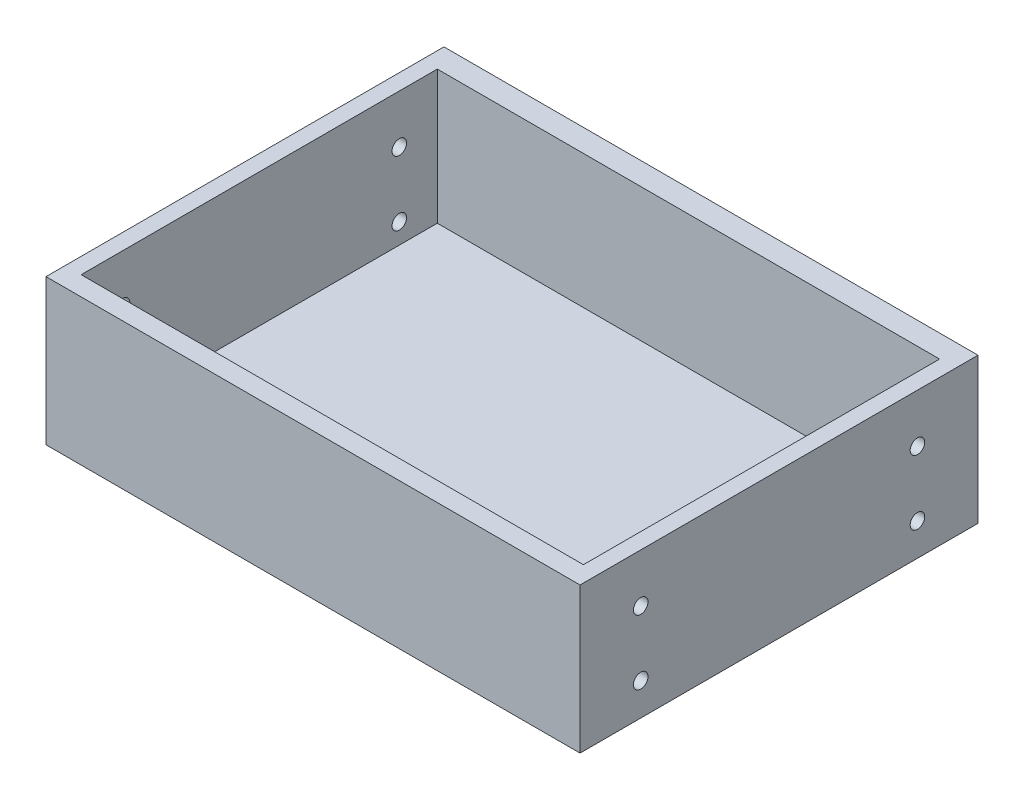
ISO-10303-21;
HEADER;
FILE_DESCRIPTION(('STEP AP214'),'2;1');
FILE_NAME('part.step','',(''),(''),'','','');
FILE_SCHEMA(('AUTOMOTIVE_DESIGN { 1 0 10303 214 1 1 1 1 }'));
ENDSEC;
DATA;
#1=APPLICATION_CONTEXT('core data for automotive mechanical design processes');
#2=APPLICATION_PROTOCOL_DEFINITION('international standard','automotive_design',2000,#1);
#3=PRODUCT_CONTEXT('',#1,'mechanical');
#4=PRODUCT('Part','Part','',(#3));
#5=PRODUCT_RELATED_PRODUCT_CATEGORY('part','',(#4));
#6=PRODUCT_DEFINITION_FORMATION('','',#4);
#7=PRODUCT_DEFINITION_CONTEXT('part definition',#1,'design');
#8=PRODUCT_DEFINITION('design','',#6,#7);
#9=PRODUCT_DEFINITION_SHAPE('','',#8);
#10=(LENGTH_UNIT() NAMED_UNIT(*) SI_UNIT(.MILLI.,.METRE.));
#11=(NAMED_UNIT(*) PLANE_ANGLE_UNIT() SI_UNIT($,.RADIAN.));
#12=(NAMED_UNIT(*) SI_UNIT($,.STERADIAN.) SOLID_ANGLE_UNIT());
#13=UNCERTAINTY_MEASURE_WITH_UNIT(LENGTH_MEASURE(1.E-05),#10,'distance_accuracy_value','');
#14=(GEOMETRIC_REPRESENTATION_CONTEXT(3) GLOBAL_UNCERTAINTY_ASSIGNED_CONTEXT((#13)) GLOBAL_UNIT_ASSIGNED_CONTEXT((#10,
#11,#12)) REPRESENTATION_CONTEXT('',''));
#15=CARTESIAN_POINT('',(0.,0.,0.));
#16=DIRECTION('',(0.,0.,1.));
#17=DIRECTION('',(1.,0.,0.));
#18=AXIS2_PLACEMENT_3D('',#15,#16,#17);
#19=CARTESIAN_POINT('',(0.,0.,0.));
#20=DIRECTION('',(0.,1.,0.));
#21=DIRECTION('',(0.,0.,1.));
#22=AXIS2_PLACEMENT_3D('',#19,#20,#21);
#23=PLANE('',#22);
#24=DIRECTION('',(0.,0.,-1.));
#25=VECTOR('',#24,1.);
#26=CARTESIAN_POINT('',(-440.,0.,0.));
#27=LINE('',#26,#25);
#28=CARTESIAN_POINT('',(-440.,0.,0.));
#29=VERTEX_POINT('',#28);
#30=CARTESIAN_POINT('',(-440.,0.,-327.889328917823));
#31=VERTEX_POINT('',#30);
#32=EDGE_CURVE('E175',#29,#31,#27,.T.);
#33=ORIENTED_EDGE('',*,*,#32,.T.);
#34=DIRECTION('',(-1.,0.,0.));
#35=VECTOR('',#34,1.);
#36=CARTESIAN_POINT('',(-1.24101232668224E-13,0.,-327.889328917823));
#37=LINE('',#36,#35);
#38=CARTESIAN_POINT('',(0.,0.,-327.889328917823));
#39=VERTEX_POINT('',#38);
#40=EDGE_CURVE('E182',#39,#31,#37,.T.);
#41=ORIENTED_EDGE('',*,*,#40,.F.);
#42=DIRECTION('',(0.,0.,-1.));
#43=VECTOR('',#42,1.);
#44=CARTESIAN_POINT('',(0.,0.,0.));
#45=LINE('',#44,#43);
#46=CARTESIAN_POINT('',(0.,0.,0.));
#47=VERTEX_POINT('',#46);
#48=EDGE_CURVE('E193',#47,#39,#45,.T.);
#49=ORIENTED_EDGE('',*,*,#48,.F.);
#50=DIRECTION('',(-1.,0.,0.));
#51=VECTOR('',#50,1.);
#52=CARTESIAN_POINT('',(0.,0.,0.));
#53=LINE('',#52,#51);
#54=EDGE_CURVE('E190',#47,#29,#53,.T.);
#55=ORIENTED_EDGE('',*,*,#54,.T.);
#56=EDGE_LOOP('',(#33,#41,#49,#55));
#57=FACE_BOUND('',#56,.T.);
#58=ADVANCED_FACE('F65',(#57),#23,.F.);
#59=CARTESIAN_POINT('',(0.,120.,0.));
#60=DIRECTION('',(-1.,0.,0.));
#61=DIRECTION('',(0.,0.,1.));
#62=AXIS2_PLACEMENT_3D('',#59,#60,#61);
#63=PLANE('',#62);
#64=CARTESIAN_POINT('',(0.,80.,-278.));
#65=DIRECTION('',(1.,0.,0.));
#66=DIRECTION('',(0.,0.,-1.));
#67=AXIS2_PLACEMENT_3D('',#64,#65,#66);
#68=CIRCLE('',#67,5.99999999999999);
#69=CARTESIAN_POINT('',(0.,80.,-284.));
#70=VERTEX_POINT('',#69);
#71=EDGE_CURVE('E286',#70,#70,#68,.T.);
#72=ORIENTED_EDGE('',*,*,#71,.F.);
#73=EDGE_LOOP('',(#72));
#74=FACE_BOUND('',#73,.T.);
#75=CARTESIAN_POINT('',(0.,26.7195606006157,-50.));
#76=DIRECTION('',(1.,0.,0.));
#77=DIRECTION('',(0.,0.,-1.));
#78=AXIS2_PLACEMENT_3D('',#75,#76,#77);
#79=CIRCLE('',#78,6.01746788141037);
#80=CARTESIAN_POINT('',(0.,26.7195606006157,-56.0174678814104));
#81=VERTEX_POINT('',#80);
#82=EDGE_CURVE('E290',#81,#81,#79,.T.);
#83=ORIENTED_EDGE('',*,*,#82,.F.);
#84=EDGE_LOOP('',(#83));
#85=FACE_BOUND('',#84,.T.);
#86=CARTESIAN_POINT('',(0.,26.7195606006157,-278.));
#87=DIRECTION('',(1.,0.,0.));
#88=DIRECTION('',(0.,0.,-1.));
#89=AXIS2_PLACEMENT_3D('',#86,#87,#88);
#90=CIRCLE('',#89,5.99999999999999);
#91=CARTESIAN_POINT('',(0.,26.7195606006157,-284.));
#92=VERTEX_POINT('',#91);
#93=EDGE_CURVE('E294',#92,#92,#90,.T.);
#94=ORIENTED_EDGE('',*,*,#93,.F.);
#95=EDGE_LOOP('',(#94));
#96=FACE_BOUND('',#95,.T.);
#97=CARTESIAN_POINT('',(0.,80.,-50.));
#98=DIRECTION('',(1.,0.,0.));
#99=DIRECTION('',(0.,0.,-1.));
#100=AXIS2_PLACEMENT_3D('',#97,#98,#99);
#101=CIRCLE('',#100,6.00000000000001);
#102=CARTESIAN_POINT('',(0.,80.,-56.));
#103=VERTEX_POINT('',#102);
#104=EDGE_CURVE('E205',#103,#103,#101,.T.);
#105=ORIENTED_EDGE('',*,*,#104,.F.);
#106=EDGE_LOOP('',(#105));
#107=FACE_BOUND('',#106,.T.);
#108=ORIENTED_EDGE('',*,*,#48,.T.);
#109=DIRECTION('',(0.,-1.,0.));
#110=VECTOR('',#109,1.);
#111=CARTESIAN_POINT('',(0.,120.,-327.889328917823));
#112=LINE('',#111,#110);
#113=CARTESIAN_POINT('',(0.,120.,-327.889328917823));
#114=VERTEX_POINT('',#113);
#115=EDGE_CURVE('E197',#114,#39,#112,.T.);
#116=ORIENTED_EDGE('',*,*,#115,.F.);
#117=DIRECTION('',(0.,0.,-1.));
#118=VECTOR('',#117,1.);
#119=CARTESIAN_POINT('',(0.,120.,0.));
#120=LINE('',#119,#118);
#121=CARTESIAN_POINT('',(0.,120.,0.));
#122=VERTEX_POINT('',#121);
#123=EDGE_CURVE('E185',#122,#114,#120,.T.);
#124=ORIENTED_EDGE('',*,*,#123,.F.);
#125=DIRECTION('',(0.,-1.,0.));
#126=VECTOR('',#125,1.);
#127=CARTESIAN_POINT('',(0.,120.,0.));
#128=LINE('',#127,#126);
#129=EDGE_CURVE('E74',#122,#47,#128,.T.);
#130=ORIENTED_EDGE('',*,*,#129,.T.);
#131=EDGE_LOOP('',(#108,#116,#124,#130));
#132=FACE_BOUND('',#131,.T.);
#133=ADVANCED_FACE('F264',(#74,#85,#96,#107,#132),#63,.F.);
#134=CARTESIAN_POINT('',(0.,120.,0.));
#135=DIRECTION('',(0.,0.,1.));
#136=DIRECTION('',(1.,0.,0.));
#137=AXIS2_PLACEMENT_3D('',#134,#135,#136);
#138=PLANE('',#137);
#139=ORIENTED_EDGE('',*,*,#54,.F.);
#140=ORIENTED_EDGE('',*,*,#129,.F.);
#141=DIRECTION('',(-1.,0.,0.));
#142=VECTOR('',#141,1.);
#143=CARTESIAN_POINT('',(0.,120.,0.));
#144=LINE('',#143,#142);
#145=CARTESIAN_POINT('',(-440.,120.,0.));
#146=VERTEX_POINT('',#145);
#147=EDGE_CURVE('E181',#122,#146,#144,.T.);
#148=ORIENTED_EDGE('',*,*,#147,.T.);
#149=DIRECTION('',(0.,-1.,0.));
#150=VECTOR('',#149,1.);
#151=CARTESIAN_POINT('',(-440.,120.,0.));
#152=LINE('',#151,#150);
#153=EDGE_CURVE('E12',#146,#29,#152,.T.);
#154=ORIENTED_EDGE('',*,*,#153,.T.);
#155=EDGE_LOOP('',(#139,#140,#148,#154));
#156=FACE_BOUND('',#155,.T.);
#157=ADVANCED_FACE('F249',(#156),#138,.T.);
#158=CARTESIAN_POINT('',(-440.,120.,0.));
#159=DIRECTION('',(-1.,0.,0.));
#160=DIRECTION('',(0.,0.,1.));
#161=AXIS2_PLACEMENT_3D('',#158,#159,#160);
#162=PLANE('',#161);
#163=CARTESIAN_POINT('',(-440.,26.7195606006157,-278.));
#164=DIRECTION('',(-1.,0.,0.));
#165=DIRECTION('',(0.,0.,1.));
#166=AXIS2_PLACEMENT_3D('',#163,#164,#165);
#167=CIRCLE('',#166,5.99999999999999);
#168=CARTESIAN_POINT('',(-440.,26.7195606006157,-272.));
#169=VERTEX_POINT('',#168);
#170=EDGE_CURVE('E163',#169,#169,#167,.T.);
#171=ORIENTED_EDGE('',*,*,#170,.F.);
#172=EDGE_LOOP('',(#171));
#173=FACE_BOUND('',#172,.T.);
#174=CARTESIAN_POINT('',(-440.,80.,-50.));
#175=DIRECTION('',(-1.,0.,0.));
#176=DIRECTION('',(0.,0.,1.));
#177=AXIS2_PLACEMENT_3D('',#174,#175,#176);
#178=CIRCLE('',#177,6.);
#179=CARTESIAN_POINT('',(-440.,80.,-44.));
#180=VERTEX_POINT('',#179);
#181=EDGE_CURVE('E236',#180,#180,#178,.T.);
#182=ORIENTED_EDGE('',*,*,#181,.F.);
#183=EDGE_LOOP('',(#182));
#184=FACE_BOUND('',#183,.T.);
#185=CARTESIAN_POINT('',(-440.,26.7195606006157,-50.));
#186=DIRECTION('',(-1.,0.,0.));
#187=DIRECTION('',(0.,0.,1.));
#188=AXIS2_PLACEMENT_3D('',#185,#186,#187);
#189=CIRCLE('',#188,6.01746788141037);
#190=CARTESIAN_POINT('',(-440.,26.7195606006157,-43.9825321185896));
#191=VERTEX_POINT('',#190);
#192=EDGE_CURVE('E234',#191,#191,#189,.T.);
#193=ORIENTED_EDGE('',*,*,#192,.F.);
#194=EDGE_LOOP('',(#193));
#195=FACE_BOUND('',#194,.T.);
#196=CARTESIAN_POINT('',(-440.,80.,-278.));
#197=DIRECTION('',(-1.,0.,0.));
#198=DIRECTION('',(0.,0.,1.));
#199=AXIS2_PLACEMENT_3D('',#196,#197,#198);
#200=CIRCLE('',#199,5.99999999999999);
#201=CARTESIAN_POINT('',(-440.,80.,-272.));
#202=VERTEX_POINT('',#201);
#203=EDGE_CURVE('E231',#202,#202,#200,.T.);
#204=ORIENTED_EDGE('',*,*,#203,.F.);
#205=EDGE_LOOP('',(#204));
#206=FACE_BOUND('',#205,.T.);
#207=ORIENTED_EDGE('',*,*,#32,.F.);
#208=ORIENTED_EDGE('',*,*,#153,.F.);
#209=DIRECTION('',(0.,0.,-1.));
#210=VECTOR('',#209,1.);
#211=CARTESIAN_POINT('',(-440.,120.,0.));
#212=LINE('',#211,#210);
#213=CARTESIAN_POINT('',(-440.,120.,-327.889328917823));
#214=VERTEX_POINT('',#213);
#215=EDGE_CURVE('E179',#146,#214,#212,.T.);
#216=ORIENTED_EDGE('',*,*,#215,.T.);
#217=DIRECTION('',(0.,-1.,0.));
#218=VECTOR('',#217,1.);
#219=CARTESIAN_POINT('',(-440.,120.,-327.889328917823));
#220=LINE('',#219,#218);
#221=EDGE_CURVE('E111',#214,#31,#220,.T.);
#222=ORIENTED_EDGE('',*,*,#221,.T.);
#223=EDGE_LOOP('',(#207,#208,#216,#222));
#224=FACE_BOUND('',#223,.T.);
#225=ADVANCED_FACE('F67',(#173,#184,#195,#206,#224),#162,.T.);
#226=CARTESIAN_POINT('',(-1.24101232668224E-13,120.,-327.889328917823));
#227=DIRECTION('',(0.,0.,1.));
#228=DIRECTION('',(1.,0.,0.));
#229=AXIS2_PLACEMENT_3D('',#226,#227,#228);
#230=PLANE('',#229);
#231=ORIENTED_EDGE('',*,*,#40,.T.);
#232=ORIENTED_EDGE('',*,*,#221,.F.);
#233=DIRECTION('',(-1.,0.,0.));
#234=VECTOR('',#233,1.);
#235=CARTESIAN_POINT('',(-1.24101232668224E-13,120.,-327.889328917823));
#236=LINE('',#235,#234);
#237=EDGE_CURVE('E91',#114,#214,#236,.T.);
#238=ORIENTED_EDGE('',*,*,#237,.F.);
#239=ORIENTED_EDGE('',*,*,#115,.T.);
#240=EDGE_LOOP('',(#231,#232,#238,#239));
#241=FACE_BOUND('',#240,.T.);
#242=ADVANCED_FACE('F248',(#241),#230,.F.);
#243=CARTESIAN_POINT('',(0.,120.,0.));
#244=DIRECTION('',(0.,1.,0.));
#245=DIRECTION('',(0.,0.,1.));
#246=AXIS2_PLACEMENT_3D('',#243,#244,#245);
#247=PLANE('',#246);
#248=DIRECTION('',(0.,0.,1.));
#249=VECTOR('',#248,1.);
#250=CARTESIAN_POINT('',(-426.908795826111,120.,-15.8670164446765));
#251=LINE('',#250,#249);
#252=CARTESIAN_POINT('',(-426.908795826111,120.,-309.308926619538));
#253=VERTEX_POINT('',#252);
#254=CARTESIAN_POINT('',(-426.908795826111,120.,-15.8670164446765));
#255=VERTEX_POINT('',#254);
#256=EDGE_CURVE('E82',#253,#255,#251,.T.);
#257=ORIENTED_EDGE('',*,*,#256,.F.);
#258=DIRECTION('',(-1.,0.,0.));
#259=VECTOR('',#258,1.);
#260=CARTESIAN_POINT('',(-13.0804609641261,120.,-309.308926619538));
#261=LINE('',#260,#259);
#262=CARTESIAN_POINT('',(-13.0804609641261,120.,-309.308926619538));
#263=VERTEX_POINT('',#262);
#264=EDGE_CURVE('E157',#263,#253,#261,.T.);
#265=ORIENTED_EDGE('',*,*,#264,.F.);
#266=DIRECTION('',(0.,0.,-1.));
#267=VECTOR('',#266,1.);
#268=CARTESIAN_POINT('',(-13.0804609641261,120.,-15.8670164446765));
#269=LINE('',#268,#267);
#270=CARTESIAN_POINT('',(-13.0804609641261,120.,-15.8670164446765));
#271=VERTEX_POINT('',#270);
#272=EDGE_CURVE('E160',#271,#263,#269,.T.);
#273=ORIENTED_EDGE('',*,*,#272,.F.);
#274=DIRECTION('',(1.,0.,0.));
#275=VECTOR('',#274,1.);
#276=CARTESIAN_POINT('',(-13.0804609641261,120.,-15.8670164446765));
#277=LINE('',#276,#275);
#278=EDGE_CURVE('E169',#255,#271,#277,.T.);
#279=ORIENTED_EDGE('',*,*,#278,.F.);
#280=EDGE_LOOP('',(#257,#265,#273,#279));
#281=FACE_BOUND('',#280,.T.);
#282=ORIENTED_EDGE('',*,*,#215,.F.);
#283=ORIENTED_EDGE('',*,*,#147,.F.);
#284=ORIENTED_EDGE('',*,*,#123,.T.);
#285=ORIENTED_EDGE('',*,*,#237,.T.);
#286=EDGE_LOOP('',(#282,#283,#284,#285));
#287=FACE_BOUND('',#286,.T.);
#288=ADVANCED_FACE('F261',(#281,#287),#247,.T.);
#289=CARTESIAN_POINT('',(-426.908795826111,10.0000000000001,-15.8670164446765));
#290=DIRECTION('',(-1.,0.,0.));
#291=DIRECTION('',(0.,0.,1.));
#292=AXIS2_PLACEMENT_3D('',#289,#290,#291);
#293=PLANE('',#292);
#294=CARTESIAN_POINT('',(-426.908795826111,26.7195606006157,-278.));
#295=DIRECTION('',(1.,0.,0.));
#296=DIRECTION('',(0.,0.,-1.));
#297=AXIS2_PLACEMENT_3D('',#294,#295,#296);
#298=CIRCLE('',#297,5.99999999999999);
#299=CARTESIAN_POINT('',(-426.908795826111,26.7195606006157,-284.));
#300=VERTEX_POINT('',#299);
#301=EDGE_CURVE('E221',#300,#300,#298,.T.);
#302=ORIENTED_EDGE('',*,*,#301,.F.);
#303=EDGE_LOOP('',(#302));
#304=FACE_BOUND('',#303,.T.);
#305=CARTESIAN_POINT('',(-426.908795826111,80.,-50.));
#306=DIRECTION('',(1.,0.,0.));
#307=DIRECTION('',(0.,0.,-1.));
#308=AXIS2_PLACEMENT_3D('',#305,#306,#307);
#309=CIRCLE('',#308,6.);
#310=CARTESIAN_POINT('',(-426.908795826111,80.,-56.));
#311=VERTEX_POINT('',#310);
#312=EDGE_CURVE('E216',#311,#311,#309,.T.);
#313=ORIENTED_EDGE('',*,*,#312,.F.);
#314=EDGE_LOOP('',(#313));
#315=FACE_BOUND('',#314,.T.);
#316=CARTESIAN_POINT('',(-426.908795826111,26.7195606006157,-50.));
#317=DIRECTION('',(1.,0.,0.));
#318=DIRECTION('',(0.,0.,-1.));
#319=AXIS2_PLACEMENT_3D('',#316,#317,#318);
#320=CIRCLE('',#319,6.01746788141037);
#321=CARTESIAN_POINT('',(-426.908795826111,26.7195606006157,-56.0174678814104));
#322=VERTEX_POINT('',#321);
#323=EDGE_CURVE('E212',#322,#322,#320,.T.);
#324=ORIENTED_EDGE('',*,*,#323,.F.);
#325=EDGE_LOOP('',(#324));
#326=FACE_BOUND('',#325,.T.);
#327=CARTESIAN_POINT('',(-426.908795826111,80.,-278.));
#328=DIRECTION('',(1.,0.,0.));
#329=DIRECTION('',(0.,0.,-1.));
#330=AXIS2_PLACEMENT_3D('',#327,#328,#329);
#331=CIRCLE('',#330,5.99999999999999);
#332=CARTESIAN_POINT('',(-426.908795826111,80.,-284.));
#333=VERTEX_POINT('',#332);
#334=EDGE_CURVE('E227',#333,#333,#331,.T.);
#335=ORIENTED_EDGE('',*,*,#334,.F.);
#336=EDGE_LOOP('',(#335));
#337=FACE_BOUND('',#336,.T.);
#338=ORIENTED_EDGE('',*,*,#256,.T.);
#339=DIRECTION('',(0.,1.,0.));
#340=VECTOR('',#339,1.);
#341=CARTESIAN_POINT('',(-426.908795826111,10.0000000000001,-15.8670164446765));
#342=LINE('',#341,#340);
#343=CARTESIAN_POINT('',(-426.908795826111,10.0000000000001,-15.8670164446765));
#344=VERTEX_POINT('',#343);
#345=EDGE_CURVE('E135',#344,#255,#342,.T.);
#346=ORIENTED_EDGE('',*,*,#345,.F.);
#347=DIRECTION('',(0.,0.,1.));
#348=VECTOR('',#347,1.);
#349=CARTESIAN_POINT('',(-426.908795826111,10.0000000000001,-15.8670164446765));
#350=LINE('',#349,#348);
#351=CARTESIAN_POINT('',(-426.908795826111,10.0000000000001,-309.308926619538));
#352=VERTEX_POINT('',#351);
#353=EDGE_CURVE('E139',#352,#344,#350,.T.);
#354=ORIENTED_EDGE('',*,*,#353,.F.);
#355=DIRECTION('',(0.,1.,0.));
#356=VECTOR('',#355,1.);
#357=CARTESIAN_POINT('',(-426.908795826111,10.0000000000001,-309.308926619538));
#358=LINE('',#357,#356);
#359=EDGE_CURVE('E173',#352,#253,#358,.T.);
#360=ORIENTED_EDGE('',*,*,#359,.T.);
#361=EDGE_LOOP('',(#338,#346,#354,#360));
#362=FACE_BOUND('',#361,.T.);
#363=ADVANCED_FACE('F137',(#304,#315,#326,#337,#362),#293,.F.);
#364=CARTESIAN_POINT('',(-13.0804609641261,10.0000000000001,-309.308926619538));
#365=DIRECTION('',(0.,0.,-1.));
#366=DIRECTION('',(-1.,0.,0.));
#367=AXIS2_PLACEMENT_3D('',#364,#365,#366);
#368=PLANE('',#367);
#369=ORIENTED_EDGE('',*,*,#264,.T.);
#370=ORIENTED_EDGE('',*,*,#359,.F.);
#371=DIRECTION('',(-1.,0.,0.));
#372=VECTOR('',#371,1.);
#373=CARTESIAN_POINT('',(-13.0804609641261,10.0000000000001,-309.308926619538));
#374=LINE('',#373,#372);
#375=CARTESIAN_POINT('',(-13.0804609641261,10.0000000000001,-309.308926619538));
#376=VERTEX_POINT('',#375);
#377=EDGE_CURVE('E145',#376,#352,#374,.T.);
#378=ORIENTED_EDGE('',*,*,#377,.F.);
#379=DIRECTION('',(0.,1.,0.));
#380=VECTOR('',#379,1.);
#381=CARTESIAN_POINT('',(-13.0804609641261,10.0000000000001,-309.308926619538));
#382=LINE('',#381,#380);
#383=EDGE_CURVE('E176',#376,#263,#382,.T.);
#384=ORIENTED_EDGE('',*,*,#383,.T.);
#385=EDGE_LOOP('',(#369,#370,#378,#384));
#386=FACE_BOUND('',#385,.T.);
#387=ADVANCED_FACE('F332',(#386),#368,.F.);
#388=CARTESIAN_POINT('',(-13.0804609641261,10.0000000000001,-15.8670164446765));
#389=DIRECTION('',(1.,0.,0.));
#390=DIRECTION('',(0.,0.,-1.));
#391=AXIS2_PLACEMENT_3D('',#388,#389,#390);
#392=PLANE('',#391);
#393=CARTESIAN_POINT('',(-13.0804609641261,80.,-278.));
#394=DIRECTION('',(1.,0.,0.));
#395=DIRECTION('',(0.,0.,-1.));
#396=AXIS2_PLACEMENT_3D('',#393,#394,#395);
#397=CIRCLE('',#396,5.99999999999999);
#398=CARTESIAN_POINT('',(-13.0804609641261,80.,-284.));
#399=VERTEX_POINT('',#398);
#400=EDGE_CURVE('E69',#399,#399,#397,.T.);
#401=ORIENTED_EDGE('',*,*,#400,.T.);
#402=EDGE_LOOP('',(#401));
#403=FACE_BOUND('',#402,.T.);
#404=CARTESIAN_POINT('',(-13.0804609641261,26.7195606006157,-50.));
#405=DIRECTION('',(1.,0.,0.));
#406=DIRECTION('',(0.,0.,-1.));
#407=AXIS2_PLACEMENT_3D('',#404,#405,#406);
#408=CIRCLE('',#407,6.01746788141037);
#409=CARTESIAN_POINT('',(-13.0804609641261,26.7195606006157,-56.0174678814104));
#410=VERTEX_POINT('',#409);
#411=EDGE_CURVE('E207',#410,#410,#408,.T.);
#412=ORIENTED_EDGE('',*,*,#411,.T.);
#413=EDGE_LOOP('',(#412));
#414=FACE_BOUND('',#413,.T.);
#415=CARTESIAN_POINT('',(-13.0804609641261,26.7195606006157,-278.));
#416=DIRECTION('',(1.,0.,0.));
#417=DIRECTION('',(0.,0.,-1.));
#418=AXIS2_PLACEMENT_3D('',#415,#416,#417);
#419=CIRCLE('',#418,5.99999999999999);
#420=CARTESIAN_POINT('',(-13.0804609641261,26.7195606006157,-284.));
#421=VERTEX_POINT('',#420);
#422=EDGE_CURVE('E204',#421,#421,#419,.T.);
#423=ORIENTED_EDGE('',*,*,#422,.T.);
#424=EDGE_LOOP('',(#423));
#425=FACE_BOUND('',#424,.T.);
#426=CARTESIAN_POINT('',(-13.0804609641261,80.,-50.));
#427=DIRECTION('',(1.,0.,0.));
#428=DIRECTION('',(0.,0.,-1.));
#429=AXIS2_PLACEMENT_3D('',#426,#427,#428);
#430=CIRCLE('',#429,6.00000000000001);
#431=CARTESIAN_POINT('',(-13.0804609641261,80.,-56.));
#432=VERTEX_POINT('',#431);
#433=EDGE_CURVE('E201',#432,#432,#430,.T.);
#434=ORIENTED_EDGE('',*,*,#433,.T.);
#435=EDGE_LOOP('',(#434));
#436=FACE_BOUND('',#435,.T.);
#437=ORIENTED_EDGE('',*,*,#272,.T.);
#438=ORIENTED_EDGE('',*,*,#383,.F.);
#439=DIRECTION('',(0.,0.,-1.));
#440=VECTOR('',#439,1.);
#441=CARTESIAN_POINT('',(-13.0804609641261,10.0000000000001,-15.8670164446765));
#442=LINE('',#441,#440);
#443=CARTESIAN_POINT('',(-13.0804609641261,10.0000000000001,-15.8670164446765));
#444=VERTEX_POINT('',#443);
#445=EDGE_CURVE('E153',#444,#376,#442,.T.);
#446=ORIENTED_EDGE('',*,*,#445,.F.);
#447=DIRECTION('',(0.,1.,0.));
#448=VECTOR('',#447,1.);
#449=CARTESIAN_POINT('',(-13.0804609641261,10.0000000000001,-15.8670164446765));
#450=LINE('',#449,#448);
#451=EDGE_CURVE('E144',#444,#271,#450,.T.);
#452=ORIENTED_EDGE('',*,*,#451,.T.);
#453=EDGE_LOOP('',(#437,#438,#446,#452));
#454=FACE_BOUND('',#453,.T.);
#455=ADVANCED_FACE('F335',(#403,#414,#425,#436,#454),#392,.F.);
#456=CARTESIAN_POINT('',(-13.0804609641261,10.0000000000001,-15.8670164446765));
#457=DIRECTION('',(0.,0.,1.));
#458=DIRECTION('',(1.,0.,0.));
#459=AXIS2_PLACEMENT_3D('',#456,#457,#458);
#460=PLANE('',#459);
#461=ORIENTED_EDGE('',*,*,#278,.T.);
#462=ORIENTED_EDGE('',*,*,#451,.F.);
#463=DIRECTION('',(1.,0.,0.));
#464=VECTOR('',#463,1.);
#465=CARTESIAN_POINT('',(-13.0804609641261,10.0000000000001,-15.8670164446765));
#466=LINE('',#465,#464);
#467=EDGE_CURVE('E148',#344,#444,#466,.T.);
#468=ORIENTED_EDGE('',*,*,#467,.F.);
#469=ORIENTED_EDGE('',*,*,#345,.T.);
#470=EDGE_LOOP('',(#461,#462,#468,#469));
#471=FACE_BOUND('',#470,.T.);
#472=ADVANCED_FACE('F149',(#471),#460,.F.);
#473=CARTESIAN_POINT('',(0.,10.0000000000001,0.));
#474=DIRECTION('',(0.,1.,0.));
#475=DIRECTION('',(0.,0.,1.));
#476=AXIS2_PLACEMENT_3D('',#473,#474,#475);
#477=PLANE('',#476);
#478=ORIENTED_EDGE('',*,*,#353,.T.);
#479=ORIENTED_EDGE('',*,*,#467,.T.);
#480=ORIENTED_EDGE('',*,*,#445,.T.);
#481=ORIENTED_EDGE('',*,*,#377,.T.);
#482=EDGE_LOOP('',(#478,#479,#480,#481));
#483=FACE_BOUND('',#482,.T.);
#484=ADVANCED_FACE('F155',(#483),#477,.T.);
#485=CARTESIAN_POINT('',(-536.908795826111,80.,-278.));
#486=DIRECTION('',(1.,0.,0.));
#487=DIRECTION('',(0.,0.,-1.));
#488=AXIS2_PLACEMENT_3D('',#485,#486,#487);
#489=CYLINDRICAL_SURFACE('',#488,5.99999999999999);
#490=ORIENTED_EDGE('',*,*,#203,.T.);
#491=EDGE_LOOP('',(#490));
#492=FACE_BOUND('',#491,.T.);
#493=ORIENTED_EDGE('',*,*,#334,.T.);
#494=EDGE_LOOP('',(#493));
#495=FACE_BOUND('',#494,.T.);
#496=ADVANCED_FACE('F322',(#492,#495),#489,.F.);
#497=CARTESIAN_POINT('',(-536.908795826111,26.7195606006157,-50.));
#498=DIRECTION('',(1.,0.,0.));
#499=DIRECTION('',(0.,0.,-1.));
#500=AXIS2_PLACEMENT_3D('',#497,#498,#499);
#501=CYLINDRICAL_SURFACE('',#500,6.01746788141037);
#502=ORIENTED_EDGE('',*,*,#192,.T.);
#503=EDGE_LOOP('',(#502));
#504=FACE_BOUND('',#503,.T.);
#505=ORIENTED_EDGE('',*,*,#323,.T.);
#506=EDGE_LOOP('',(#505));
#507=FACE_BOUND('',#506,.T.);
#508=ADVANCED_FACE('F318',(#504,#507),#501,.F.);
#509=CARTESIAN_POINT('',(-536.908795826111,80.,-50.));
#510=DIRECTION('',(1.,0.,0.));
#511=DIRECTION('',(0.,0.,-1.));
#512=AXIS2_PLACEMENT_3D('',#509,#510,#511);
#513=CYLINDRICAL_SURFACE('',#512,6.);
#514=ORIENTED_EDGE('',*,*,#181,.T.);
#515=EDGE_LOOP('',(#514));
#516=FACE_BOUND('',#515,.T.);
#517=ORIENTED_EDGE('',*,*,#312,.T.);
#518=EDGE_LOOP('',(#517));
#519=FACE_BOUND('',#518,.T.);
#520=ADVANCED_FACE('F321',(#516,#519),#513,.F.);
#521=CARTESIAN_POINT('',(-536.908795826111,26.7195606006157,-278.));
#522=DIRECTION('',(1.,0.,0.));
#523=DIRECTION('',(0.,0.,-1.));
#524=AXIS2_PLACEMENT_3D('',#521,#522,#523);
#525=CYLINDRICAL_SURFACE('',#524,5.99999999999999);
#526=ORIENTED_EDGE('',*,*,#170,.T.);
#527=EDGE_LOOP('',(#526));
#528=FACE_BOUND('',#527,.T.);
#529=ORIENTED_EDGE('',*,*,#301,.T.);
#530=EDGE_LOOP('',(#529));
#531=FACE_BOUND('',#530,.T.);
#532=ADVANCED_FACE('F243',(#528,#531),#525,.F.);
#533=CARTESIAN_POINT('',(-110.,80.,-50.));
#534=DIRECTION('',(1.,0.,0.));
#535=DIRECTION('',(0.,0.,-1.));
#536=AXIS2_PLACEMENT_3D('',#533,#534,#535);
#537=CYLINDRICAL_SURFACE('',#536,6.00000000000001);
#538=ORIENTED_EDGE('',*,*,#104,.T.);
#539=EDGE_LOOP('',(#538));
#540=FACE_BOUND('',#539,.T.);
#541=ORIENTED_EDGE('',*,*,#433,.F.);
#542=EDGE_LOOP('',(#541));
#543=FACE_BOUND('',#542,.T.);
#544=ADVANCED_FACE('F315',(#540,#543),#537,.F.);
#545=CARTESIAN_POINT('',(-110.,26.7195606006157,-278.));
#546=DIRECTION('',(1.,0.,0.));
#547=DIRECTION('',(0.,0.,-1.));
#548=AXIS2_PLACEMENT_3D('',#545,#546,#547);
#549=CYLINDRICAL_SURFACE('',#548,5.99999999999999);
#550=ORIENTED_EDGE('',*,*,#93,.T.);
#551=EDGE_LOOP('',(#550));
#552=FACE_BOUND('',#551,.T.);
#553=ORIENTED_EDGE('',*,*,#422,.F.);
#554=EDGE_LOOP('',(#553));
#555=FACE_BOUND('',#554,.T.);
#556=ADVANCED_FACE('F310',(#552,#555),#549,.F.);
#557=CARTESIAN_POINT('',(-110.,26.7195606006157,-50.));
#558=DIRECTION('',(1.,0.,0.));
#559=DIRECTION('',(0.,0.,-1.));
#560=AXIS2_PLACEMENT_3D('',#557,#558,#559);
#561=CYLINDRICAL_SURFACE('',#560,6.01746788141037);
#562=ORIENTED_EDGE('',*,*,#82,.T.);
#563=EDGE_LOOP('',(#562));
#564=FACE_BOUND('',#563,.T.);
#565=ORIENTED_EDGE('',*,*,#411,.F.);
#566=EDGE_LOOP('',(#565));
#567=FACE_BOUND('',#566,.T.);
#568=ADVANCED_FACE('F305',(#564,#567),#561,.F.);
#569=CARTESIAN_POINT('',(-110.,80.,-278.));
#570=DIRECTION('',(1.,0.,0.));
#571=DIRECTION('',(0.,0.,-1.));
#572=AXIS2_PLACEMENT_3D('',#569,#570,#571);
#573=CYLINDRICAL_SURFACE('',#572,5.99999999999999);
#574=ORIENTED_EDGE('',*,*,#71,.T.);
#575=EDGE_LOOP('',(#574));
#576=FACE_BOUND('',#575,.T.);
#577=ORIENTED_EDGE('',*,*,#400,.F.);
#578=EDGE_LOOP('',(#577));
#579=FACE_BOUND('',#578,.T.);
#580=ADVANCED_FACE('F302',(#576,#579),#573,.F.);
#581=CLOSED_SHELL('',(#58,#133,#157,#225,#242,#288,#363,#387,#455,#472,#484,#496,#508,#520,#532,
#544,#556,#568,#580));
#582=MANIFOLD_SOLID_BREP('B2',#581);
#583=ADVANCED_BREP_SHAPE_REPRESENTATION('',(#18,#582),#14);
#584=SHAPE_DEFINITION_REPRESENTATION(#9,#583);
ENDSEC;
END-ISO-10303-21;
